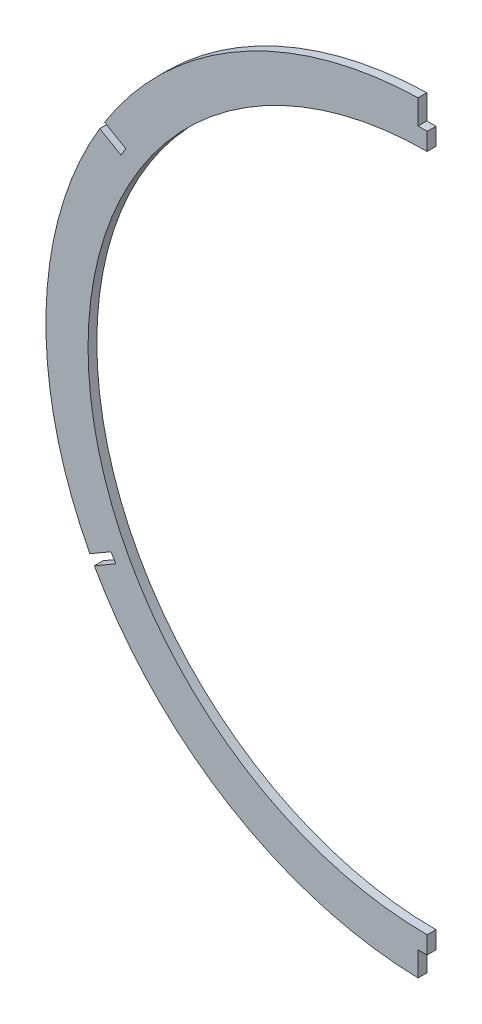
ISO-10303-21;
HEADER;
FILE_DESCRIPTION(('STEP AP214'),'2;1');
FILE_NAME('part.step','',(''),(''),'','','');
FILE_SCHEMA(('AUTOMOTIVE_DESIGN { 1 0 10303 214 1 1 1 1 }'));
ENDSEC;
DATA;
#1=APPLICATION_CONTEXT('core data for automotive mechanical design processes');
#2=APPLICATION_PROTOCOL_DEFINITION('international standard','automotive_design',2000,#1);
#3=PRODUCT_CONTEXT('',#1,'mechanical');
#4=PRODUCT('Part','Part','',(#3));
#5=PRODUCT_RELATED_PRODUCT_CATEGORY('part','',(#4));
#6=PRODUCT_DEFINITION_FORMATION('','',#4);
#7=PRODUCT_DEFINITION_CONTEXT('part definition',#1,'design');
#8=PRODUCT_DEFINITION('design','',#6,#7);
#9=PRODUCT_DEFINITION_SHAPE('','',#8);
#10=(LENGTH_UNIT() NAMED_UNIT(*) SI_UNIT(.MILLI.,.METRE.));
#11=(NAMED_UNIT(*) PLANE_ANGLE_UNIT() SI_UNIT($,.RADIAN.));
#12=(NAMED_UNIT(*) SI_UNIT($,.STERADIAN.) SOLID_ANGLE_UNIT());
#13=UNCERTAINTY_MEASURE_WITH_UNIT(LENGTH_MEASURE(1.E-05),#10,'distance_accuracy_value','');
#14=(GEOMETRIC_REPRESENTATION_CONTEXT(3) GLOBAL_UNCERTAINTY_ASSIGNED_CONTEXT((#13)) GLOBAL_UNIT_ASSIGNED_CONTEXT((#10,
#11,#12)) REPRESENTATION_CONTEXT('',''));
#15=CARTESIAN_POINT('',(0.,0.,0.));
#16=DIRECTION('',(0.,0.,1.));
#17=DIRECTION('',(1.,0.,0.));
#18=AXIS2_PLACEMENT_3D('',#15,#16,#17);
#19=CARTESIAN_POINT('',(0.,12.6999999999999,-1.58750000000003));
#20=DIRECTION('',(0.,0.,-1.));
#21=DIRECTION('',(0.,1.,0.));
#22=AXIS2_PLACEMENT_3D('',#19,#20,#21);
#23=PLANE('',#22);
#24=CARTESIAN_POINT('',(0.,12.6999999999999,-1.58750000000003));
#25=DIRECTION('',(0.,0.,-1.));
#26=DIRECTION('',(0.,1.,0.));
#27=AXIS2_PLACEMENT_3D('',#24,#25,#26);
#28=CIRCLE('',#27,137.922);
#29=CARTESIAN_POINT('',(-116.699944513499,86.2091901366513,-1.58750000000004));
#30=VERTEX_POINT('',#29);
#31=CARTESIAN_POINT('',(-3.30200000000001,150.58246763095,-1.58750000000004));
#32=VERTEX_POINT('',#31);
#33=EDGE_CURVE('E170',#30,#32,#28,.T.);
#34=ORIENTED_EDGE('',*,*,#33,.T.);
#35=DIRECTION('',(0.,1.,0.));
#36=VECTOR('',#35,1.);
#37=CARTESIAN_POINT('',(-3.30200000000001,0.,-1.58750000000004));
#38=LINE('',#37,#36);
#39=CARTESIAN_POINT('',(-3.30200000000001,141.732,-1.58750000000004));
#40=VERTEX_POINT('',#39);
#41=EDGE_CURVE('E152',#40,#32,#38,.T.);
#42=ORIENTED_EDGE('',*,*,#41,.F.);
#43=DIRECTION('',(1.,0.,0.));
#44=VECTOR('',#43,1.);
#45=CARTESIAN_POINT('',(0.,141.732,-1.58750000000004));
#46=LINE('',#45,#44);
#47=CARTESIAN_POINT('',(0.,141.732,-1.58750000000004));
#48=VERTEX_POINT('',#47);
#49=EDGE_CURVE('E159',#40,#48,#46,.T.);
#50=ORIENTED_EDGE('',*,*,#49,.T.);
#51=DIRECTION('',(0.,-1.,0.));
#52=VECTOR('',#51,1.);
#53=CARTESIAN_POINT('',(0.,12.6999999999999,-1.58750000000003));
#54=LINE('',#53,#52);
#55=CARTESIAN_POINT('',(0.,135.382,-1.58750000000003));
#56=VERTEX_POINT('',#55);
#57=EDGE_CURVE('E248',#48,#56,#54,.T.);
#58=ORIENTED_EDGE('',*,*,#57,.T.);
#59=CARTESIAN_POINT('',(0.,12.6999999999999,-1.58750000000003));
#60=DIRECTION('',(0.,0.,-1.));
#61=DIRECTION('',(0.,1.,0.));
#62=AXIS2_PLACEMENT_3D('',#59,#60,#61);
#63=CIRCLE('',#62,122.682);
#64=CARTESIAN_POINT('',(0.,-109.982,-1.58750000000002));
#65=VERTEX_POINT('',#64);
#66=EDGE_CURVE('E249',#65,#56,#63,.T.);
#67=ORIENTED_EDGE('',*,*,#66,.F.);
#68=CARTESIAN_POINT('',(0.,-116.332,-1.58750000000002));
#69=VERTEX_POINT('',#68);
#70=EDGE_CURVE('E244',#65,#69,#54,.T.);
#71=ORIENTED_EDGE('',*,*,#70,.T.);
#72=DIRECTION('',(1.,0.,0.));
#73=VECTOR('',#72,1.);
#74=CARTESIAN_POINT('',(0.,-116.332,-1.58750000000004));
#75=LINE('',#74,#73);
#76=CARTESIAN_POINT('',(-3.30200000000001,-116.332,-1.58750000000004));
#77=VERTEX_POINT('',#76);
#78=EDGE_CURVE('E226',#77,#69,#75,.T.);
#79=ORIENTED_EDGE('',*,*,#78,.F.);
#80=DIRECTION('',(0.,-1.,0.));
#81=VECTOR('',#80,1.);
#82=CARTESIAN_POINT('',(-3.30200000000001,0.,-1.58750000000004));
#83=LINE('',#82,#81);
#84=CARTESIAN_POINT('',(-3.30200000000001,-125.18246763095,-1.58750000000004));
#85=VERTEX_POINT('',#84);
#86=EDGE_CURVE('E228',#77,#85,#83,.T.);
#87=ORIENTED_EDGE('',*,*,#86,.T.);
#88=CARTESIAN_POINT('',(-120.398555387567,-54.5805019644396,-1.58750000000004));
#89=VERTEX_POINT('',#88);
#90=EDGE_CURVE('E259',#85,#89,#28,.T.);
#91=ORIENTED_EDGE('',*,*,#90,.T.);
#92=DIRECTION('',(-0.86602540378444,-0.499999999999999,0.));
#93=VECTOR('',#92,1.);
#94=CARTESIAN_POINT('',(-6.46558822063608,11.1987272989606,-1.58750000000004));
#95=LINE('',#94,#93);
#96=CARTESIAN_POINT('',(-112.665009205345,-50.1155369943434,-1.58750000000004));
#97=VERTEX_POINT('',#96);
#98=EDGE_CURVE('E203',#97,#89,#95,.T.);
#99=ORIENTED_EDGE('',*,*,#98,.F.);
#100=DIRECTION('',(-0.499999999999911,0.86602540378449,0.));
#101=VECTOR('',#100,1.);
#102=CARTESIAN_POINT('',(-106.199420984716,-61.3142642932939,-1.58750000000004));
#103=LINE('',#102,#101);
#104=CARTESIAN_POINT('',(-114.354109205345,-47.1899299752789,-1.58750000000004));
#105=VERTEX_POINT('',#104);
#106=EDGE_CURVE('E205',#97,#105,#103,.T.);
#107=ORIENTED_EDGE('',*,*,#106,.T.);
#108=DIRECTION('',(-0.866025403784449,-0.499999999999982,0.));
#109=VECTOR('',#108,1.);
#110=CARTESIAN_POINT('',(-8.1546882206345,14.1243343180231,-1.58750000000004));
#111=LINE('',#110,#109);
#112=CARTESIAN_POINT('',(-122.010798326709,-51.6105215005997,-1.58750000000004));
#113=VERTEX_POINT('',#112);
#114=EDGE_CURVE('E208',#105,#113,#111,.T.);
#115=ORIENTED_EDGE('',*,*,#114,.T.);
#116=CARTESIAN_POINT('',(-118.465901574357,83.3279565623618,-1.58750000000004));
#117=VERTEX_POINT('',#116);
#118=EDGE_CURVE('E257',#113,#117,#28,.T.);
#119=ORIENTED_EDGE('',*,*,#118,.T.);
#120=DIRECTION('',(-0.866025403784439,0.5,0.));
#121=VECTOR('',#120,1.);
#122=CARTESIAN_POINT('',(6.46558822063663,11.1987272989615,-1.58750000000004));
#123=LINE('',#122,#121);
#124=CARTESIAN_POINT('',(-110.732355392123,78.8629915922589,-1.58750000000004));
#125=VERTEX_POINT('',#124);
#126=EDGE_CURVE('E186',#125,#117,#123,.T.);
#127=ORIENTED_EDGE('',*,*,#126,.F.);
#128=DIRECTION('',(-0.5,-0.866025403784438,0.));
#129=VECTOR('',#128,1.);
#130=CARTESIAN_POINT('',(-117.19794361276,67.6642642932974,-1.58750000000004));
#131=LINE('',#130,#129);
#132=CARTESIAN_POINT('',(-109.043255392123,81.7885986113238,-1.58750000000004));
#133=VERTEX_POINT('',#132);
#134=EDGE_CURVE('E181',#133,#125,#131,.T.);
#135=ORIENTED_EDGE('',*,*,#134,.F.);
#136=DIRECTION('',(-0.866025403784438,0.500000000000002,0.));
#137=VECTOR('',#136,1.);
#138=CARTESIAN_POINT('',(8.15468822063672,14.1243343180262,-1.58750000000004));
#139=LINE('',#138,#137);
#140=EDGE_CURVE('E183',#133,#30,#139,.T.);
#141=ORIENTED_EDGE('',*,*,#140,.T.);
#142=EDGE_LOOP('',(#34,#42,#50,#58,#67,#71,#79,#87,#91,#99,#107,#115,#119,#127,#135,#141));
#143=FACE_BOUND('',#142,.T.);
#144=ADVANCED_FACE('F36',(#143),#23,.T.);
#145=CARTESIAN_POINT('',(0.,12.6999999999999,1.58749999999997));
#146=DIRECTION('',(0.,0.,-1.));
#147=DIRECTION('',(0.,1.,0.));
#148=AXIS2_PLACEMENT_3D('',#145,#146,#147);
#149=PLANE('',#148);
#150=DIRECTION('',(0.,1.,0.));
#151=VECTOR('',#150,1.);
#152=CARTESIAN_POINT('',(-3.30200000000001,0.,1.58749999999997));
#153=LINE('',#152,#151);
#154=CARTESIAN_POINT('',(-3.30200000000001,141.732,1.58749999999997));
#155=VERTEX_POINT('',#154);
#156=CARTESIAN_POINT('',(-3.30200000000001,150.58246763095,1.58749999999997));
#157=VERTEX_POINT('',#156);
#158=EDGE_CURVE('E155',#155,#157,#153,.T.);
#159=ORIENTED_EDGE('',*,*,#158,.T.);
#160=CARTESIAN_POINT('',(0.,12.6999999999999,1.58749999999997));
#161=DIRECTION('',(0.,0.,-1.));
#162=DIRECTION('',(0.,1.,0.));
#163=AXIS2_PLACEMENT_3D('',#160,#161,#162);
#164=CIRCLE('',#163,137.922);
#165=CARTESIAN_POINT('',(-116.699944513499,86.2091901366513,1.58749999999997));
#166=VERTEX_POINT('',#165);
#167=EDGE_CURVE('E252',#166,#157,#164,.T.);
#168=ORIENTED_EDGE('',*,*,#167,.F.);
#169=DIRECTION('',(-0.866025403784438,0.500000000000002,0.));
#170=VECTOR('',#169,1.);
#171=CARTESIAN_POINT('',(8.15468822063672,14.1243343180262,1.58749999999997));
#172=LINE('',#171,#170);
#173=CARTESIAN_POINT('',(-109.043255392123,81.7885986113238,1.58749999999997));
#174=VERTEX_POINT('',#173);
#175=EDGE_CURVE('E51',#174,#166,#172,.T.);
#176=ORIENTED_EDGE('',*,*,#175,.F.);
#177=DIRECTION('',(-0.5,-0.866025403784438,0.));
#178=VECTOR('',#177,1.);
#179=CARTESIAN_POINT('',(-117.19794361276,67.6642642932974,1.58749999999997));
#180=LINE('',#179,#178);
#181=CARTESIAN_POINT('',(-110.732355392123,78.8629915922589,1.58749999999997));
#182=VERTEX_POINT('',#181);
#183=EDGE_CURVE('E189',#174,#182,#180,.T.);
#184=ORIENTED_EDGE('',*,*,#183,.T.);
#185=DIRECTION('',(-0.866025403784439,0.5,0.));
#186=VECTOR('',#185,1.);
#187=CARTESIAN_POINT('',(6.46558822063663,11.1987272989615,1.58749999999997));
#188=LINE('',#187,#186);
#189=CARTESIAN_POINT('',(-118.465901574357,83.3279565623618,1.58749999999997));
#190=VERTEX_POINT('',#189);
#191=EDGE_CURVE('E184',#182,#190,#188,.T.);
#192=ORIENTED_EDGE('',*,*,#191,.T.);
#193=CARTESIAN_POINT('',(-122.010798326709,-51.6105215005997,1.58749999999998));
#194=VERTEX_POINT('',#193);
#195=EDGE_CURVE('E261',#194,#190,#164,.T.);
#196=ORIENTED_EDGE('',*,*,#195,.F.);
#197=DIRECTION('',(-0.866025403784449,-0.499999999999982,0.));
#198=VECTOR('',#197,1.);
#199=CARTESIAN_POINT('',(-8.1546882206345,14.1243343180231,1.58749999999997));
#200=LINE('',#199,#198);
#201=CARTESIAN_POINT('',(-114.354109205345,-47.1899299752789,1.58749999999997));
#202=VERTEX_POINT('',#201);
#203=EDGE_CURVE('E59',#202,#194,#200,.T.);
#204=ORIENTED_EDGE('',*,*,#203,.F.);
#205=DIRECTION('',(-0.499999999999911,0.86602540378449,0.));
#206=VECTOR('',#205,1.);
#207=CARTESIAN_POINT('',(-106.199420984716,-61.3142642932939,1.58749999999997));
#208=LINE('',#207,#206);
#209=CARTESIAN_POINT('',(-112.665009205345,-50.1155369943434,1.58749999999997));
#210=VERTEX_POINT('',#209);
#211=EDGE_CURVE('E215',#210,#202,#208,.T.);
#212=ORIENTED_EDGE('',*,*,#211,.F.);
#213=DIRECTION('',(-0.86602540378444,-0.499999999999999,0.));
#214=VECTOR('',#213,1.);
#215=CARTESIAN_POINT('',(-6.46558822063608,11.1987272989606,1.58749999999997));
#216=LINE('',#215,#214);
#217=CARTESIAN_POINT('',(-120.398555387567,-54.5805019644396,1.58749999999997));
#218=VERTEX_POINT('',#217);
#219=EDGE_CURVE('E212',#210,#218,#216,.T.);
#220=ORIENTED_EDGE('',*,*,#219,.T.);
#221=CARTESIAN_POINT('',(-3.30200000000001,-125.18246763095,1.58749999999997));
#222=VERTEX_POINT('',#221);
#223=EDGE_CURVE('E258',#222,#218,#164,.T.);
#224=ORIENTED_EDGE('',*,*,#223,.F.);
#225=DIRECTION('',(0.,-1.,0.));
#226=VECTOR('',#225,1.);
#227=CARTESIAN_POINT('',(-3.30200000000001,0.,1.58749999999997));
#228=LINE('',#227,#226);
#229=CARTESIAN_POINT('',(-3.30200000000001,-116.332,1.58749999999997));
#230=VERTEX_POINT('',#229);
#231=EDGE_CURVE('E229',#230,#222,#228,.T.);
#232=ORIENTED_EDGE('',*,*,#231,.F.);
#233=DIRECTION('',(1.,0.,0.));
#234=VECTOR('',#233,1.);
#235=CARTESIAN_POINT('',(0.,-116.332,1.58749999999997));
#236=LINE('',#235,#234);
#237=CARTESIAN_POINT('',(0.,-116.332,1.58749999999997));
#238=VERTEX_POINT('',#237);
#239=EDGE_CURVE('E233',#230,#238,#236,.T.);
#240=ORIENTED_EDGE('',*,*,#239,.T.);
#241=DIRECTION('',(0.,-1.,0.));
#242=VECTOR('',#241,1.);
#243=CARTESIAN_POINT('',(0.,12.6999999999999,1.58749999999997));
#244=LINE('',#243,#242);
#245=CARTESIAN_POINT('',(0.,-109.982,1.58749999999997));
#246=VERTEX_POINT('',#245);
#247=EDGE_CURVE('E179',#246,#238,#244,.T.);
#248=ORIENTED_EDGE('',*,*,#247,.F.);
#249=CARTESIAN_POINT('',(0.,12.6999999999999,1.58749999999997));
#250=DIRECTION('',(0.,0.,-1.));
#251=DIRECTION('',(0.,1.,0.));
#252=AXIS2_PLACEMENT_3D('',#249,#250,#251);
#253=CIRCLE('',#252,122.682);
#254=CARTESIAN_POINT('',(0.,135.382,1.58749999999997));
#255=VERTEX_POINT('',#254);
#256=EDGE_CURVE('E253',#246,#255,#253,.T.);
#257=ORIENTED_EDGE('',*,*,#256,.T.);
#258=CARTESIAN_POINT('',(0.,141.732,1.58749999999996));
#259=VERTEX_POINT('',#258);
#260=EDGE_CURVE('E245',#259,#255,#244,.T.);
#261=ORIENTED_EDGE('',*,*,#260,.F.);
#262=DIRECTION('',(1.,0.,0.));
#263=VECTOR('',#262,1.);
#264=CARTESIAN_POINT('',(0.,141.732,1.58749999999997));
#265=LINE('',#264,#263);
#266=EDGE_CURVE('E171',#155,#259,#265,.T.);
#267=ORIENTED_EDGE('',*,*,#266,.F.);
#268=EDGE_LOOP('',(#159,#168,#176,#184,#192,#196,#204,#212,#220,#224,#232,#240,#248,#257,#261,#267));
#269=FACE_BOUND('',#268,.T.);
#270=ADVANCED_FACE('F283',(#269),#149,.F.);
#271=CARTESIAN_POINT('',(0.,12.6999999999999,-1.58750000000003));
#272=DIRECTION('',(0.,0.,1.));
#273=DIRECTION('',(0.,-1.,0.));
#274=AXIS2_PLACEMENT_3D('',#271,#272,#273);
#275=CYLINDRICAL_SURFACE('',#274,137.922);
#276=DIRECTION('',(0.,0.,1.));
#277=VECTOR('',#276,1.);
#278=CARTESIAN_POINT('',(-3.30200000000001,150.58246763095,-1.58750000000004));
#279=LINE('',#278,#277);
#280=EDGE_CURVE('E177',#32,#157,#279,.T.);
#281=ORIENTED_EDGE('',*,*,#280,.F.);
#282=ORIENTED_EDGE('',*,*,#33,.F.);
#283=DIRECTION('',(0.,0.,1.));
#284=VECTOR('',#283,1.);
#285=CARTESIAN_POINT('',(-116.699944513499,86.2091901366513,-1.58750000000004));
#286=LINE('',#285,#284);
#287=EDGE_CURVE('E200',#30,#166,#286,.T.);
#288=ORIENTED_EDGE('',*,*,#287,.T.);
#289=ORIENTED_EDGE('',*,*,#167,.T.);
#290=EDGE_LOOP('',(#281,#282,#288,#289));
#291=FACE_BOUND('',#290,.T.);
#292=ADVANCED_FACE('F38',(#291),#275,.T.);
#293=DIRECTION('',(0.,0.,1.));
#294=VECTOR('',#293,1.);
#295=CARTESIAN_POINT('',(-118.465901574357,83.3279565623618,-1.58750000000004));
#296=LINE('',#295,#294);
#297=EDGE_CURVE('E198',#117,#190,#296,.T.);
#298=ORIENTED_EDGE('',*,*,#297,.F.);
#299=ORIENTED_EDGE('',*,*,#118,.F.);
#300=DIRECTION('',(0.,0.,1.));
#301=VECTOR('',#300,1.);
#302=CARTESIAN_POINT('',(-122.010798326709,-51.6105215005997,-1.58750000000004));
#303=LINE('',#302,#301);
#304=EDGE_CURVE('E221',#113,#194,#303,.T.);
#305=ORIENTED_EDGE('',*,*,#304,.T.);
#306=ORIENTED_EDGE('',*,*,#195,.T.);
#307=EDGE_LOOP('',(#298,#299,#305,#306));
#308=FACE_BOUND('',#307,.T.);
#309=ADVANCED_FACE('F276',(#308),#275,.T.);
#310=DIRECTION('',(0.,0.,1.));
#311=VECTOR('',#310,1.);
#312=CARTESIAN_POINT('',(-120.398555387567,-54.5805019644396,-1.58750000000004));
#313=LINE('',#312,#311);
#314=EDGE_CURVE('E192',#89,#218,#313,.T.);
#315=ORIENTED_EDGE('',*,*,#314,.F.);
#316=ORIENTED_EDGE('',*,*,#90,.F.);
#317=DIRECTION('',(0.,0.,1.));
#318=VECTOR('',#317,1.);
#319=CARTESIAN_POINT('',(-3.30200000000001,-125.18246763095,-1.58750000000004));
#320=LINE('',#319,#318);
#321=EDGE_CURVE('E238',#85,#222,#320,.T.);
#322=ORIENTED_EDGE('',*,*,#321,.T.);
#323=ORIENTED_EDGE('',*,*,#223,.T.);
#324=EDGE_LOOP('',(#315,#316,#322,#323));
#325=FACE_BOUND('',#324,.T.);
#326=ADVANCED_FACE('F308',(#325),#275,.T.);
#327=CARTESIAN_POINT('',(0.,0.,0.));
#328=DIRECTION('',(1.,0.,0.));
#329=DIRECTION('',(0.,0.,-1.));
#330=AXIS2_PLACEMENT_3D('',#327,#328,#329);
#331=PLANE('',#330);
#332=ORIENTED_EDGE('',*,*,#247,.T.);
#333=DIRECTION('',(0.,0.,1.));
#334=VECTOR('',#333,1.);
#335=CARTESIAN_POINT('',(0.,-116.332,-1.58750000000004));
#336=LINE('',#335,#334);
#337=EDGE_CURVE('E216',#69,#238,#336,.T.);
#338=ORIENTED_EDGE('',*,*,#337,.F.);
#339=ORIENTED_EDGE('',*,*,#70,.F.);
#340=DIRECTION('',(0.,0.,1.));
#341=VECTOR('',#340,1.);
#342=CARTESIAN_POINT('',(0.,-109.982,-1.58750000000002));
#343=LINE('',#342,#341);
#344=EDGE_CURVE('E44',#246,#65,#343,.F.);
#345=ORIENTED_EDGE('',*,*,#344,.F.);
#346=EDGE_LOOP('',(#332,#338,#339,#345));
#347=FACE_BOUND('',#346,.T.);
#348=ADVANCED_FACE('F301',(#347),#331,.T.);
#349=CARTESIAN_POINT('',(0.,12.6999999999999,-1.58750000000003));
#350=DIRECTION('',(0.,0.,1.));
#351=DIRECTION('',(0.,-1.,0.));
#352=AXIS2_PLACEMENT_3D('',#349,#350,#351);
#353=CYLINDRICAL_SURFACE('',#352,122.682);
#354=ORIENTED_EDGE('',*,*,#66,.T.);
#355=DIRECTION('',(0.,0.,1.));
#356=VECTOR('',#355,1.);
#357=CARTESIAN_POINT('',(0.,135.382,-1.58750000000003));
#358=LINE('',#357,#356);
#359=EDGE_CURVE('E11',#56,#255,#358,.T.);
#360=ORIENTED_EDGE('',*,*,#359,.T.);
#361=ORIENTED_EDGE('',*,*,#256,.F.);
#362=ORIENTED_EDGE('',*,*,#344,.T.);
#363=EDGE_LOOP('',(#354,#360,#361,#362));
#364=FACE_BOUND('',#363,.T.);
#365=ADVANCED_FACE('F295',(#364),#353,.F.);
#366=DIRECTION('',(0.,0.,1.));
#367=VECTOR('',#366,1.);
#368=CARTESIAN_POINT('',(0.,141.732,-1.58750000000004));
#369=LINE('',#368,#367);
#370=EDGE_CURVE('E158',#48,#259,#369,.T.);
#371=ORIENTED_EDGE('',*,*,#370,.T.);
#372=ORIENTED_EDGE('',*,*,#260,.T.);
#373=ORIENTED_EDGE('',*,*,#359,.F.);
#374=ORIENTED_EDGE('',*,*,#57,.F.);
#375=EDGE_LOOP('',(#371,#372,#373,#374));
#376=FACE_BOUND('',#375,.T.);
#377=ADVANCED_FACE('F292',(#376),#331,.T.);
#378=CARTESIAN_POINT('',(-3.30200000000001,0.,-1.58750000000004));
#379=DIRECTION('',(1.,0.,0.));
#380=DIRECTION('',(0.,0.,-1.));
#381=AXIS2_PLACEMENT_3D('',#378,#379,#380);
#382=PLANE('',#381);
#383=ORIENTED_EDGE('',*,*,#158,.F.);
#384=DIRECTION('',(0.,0.,1.));
#385=VECTOR('',#384,1.);
#386=CARTESIAN_POINT('',(-3.30200000000001,141.732,-1.58750000000004));
#387=LINE('',#386,#385);
#388=EDGE_CURVE('E148',#40,#155,#387,.T.);
#389=ORIENTED_EDGE('',*,*,#388,.F.);
#390=ORIENTED_EDGE('',*,*,#41,.T.);
#391=ORIENTED_EDGE('',*,*,#280,.T.);
#392=EDGE_LOOP('',(#383,#389,#390,#391));
#393=FACE_BOUND('',#392,.T.);
#394=ADVANCED_FACE('F150',(#393),#382,.T.);
#395=CARTESIAN_POINT('',(0.,141.732,-1.58750000000004));
#396=DIRECTION('',(0.,-1.,0.));
#397=DIRECTION('',(0.,0.,-1.));
#398=AXIS2_PLACEMENT_3D('',#395,#396,#397);
#399=PLANE('',#398);
#400=ORIENTED_EDGE('',*,*,#266,.T.);
#401=ORIENTED_EDGE('',*,*,#370,.F.);
#402=ORIENTED_EDGE('',*,*,#49,.F.);
#403=ORIENTED_EDGE('',*,*,#388,.T.);
#404=EDGE_LOOP('',(#400,#401,#402,#403));
#405=FACE_BOUND('',#404,.T.);
#406=ADVANCED_FACE('F162',(#405),#399,.F.);
#407=CARTESIAN_POINT('',(0.,-116.332,-1.58750000000004));
#408=DIRECTION('',(0.,-1.,0.));
#409=DIRECTION('',(0.,0.,-1.));
#410=AXIS2_PLACEMENT_3D('',#407,#408,#409);
#411=PLANE('',#410);
#412=ORIENTED_EDGE('',*,*,#239,.F.);
#413=DIRECTION('',(0.,0.,1.));
#414=VECTOR('',#413,1.);
#415=CARTESIAN_POINT('',(-3.30200000000001,-116.332,-1.58750000000004));
#416=LINE('',#415,#414);
#417=EDGE_CURVE('E232',#77,#230,#416,.T.);
#418=ORIENTED_EDGE('',*,*,#417,.F.);
#419=ORIENTED_EDGE('',*,*,#78,.T.);
#420=ORIENTED_EDGE('',*,*,#337,.T.);
#421=EDGE_LOOP('',(#412,#418,#419,#420));
#422=FACE_BOUND('',#421,.T.);
#423=ADVANCED_FACE('F303',(#422),#411,.T.);
#424=CARTESIAN_POINT('',(-3.30200000000001,0.,-1.58750000000004));
#425=DIRECTION('',(-1.,0.,0.));
#426=DIRECTION('',(0.,0.,1.));
#427=AXIS2_PLACEMENT_3D('',#424,#425,#426);
#428=PLANE('',#427);
#429=ORIENTED_EDGE('',*,*,#231,.T.);
#430=ORIENTED_EDGE('',*,*,#321,.F.);
#431=ORIENTED_EDGE('',*,*,#86,.F.);
#432=ORIENTED_EDGE('',*,*,#417,.T.);
#433=EDGE_LOOP('',(#429,#430,#431,#432));
#434=FACE_BOUND('',#433,.T.);
#435=ADVANCED_FACE('F326',(#434),#428,.F.);
#436=CARTESIAN_POINT('',(-6.46558822063608,11.1987272989606,-1.58750000000004));
#437=DIRECTION('',(-0.499999999999999,0.866025403784439,0.));
#438=DIRECTION('',(-0.866025403784439,-0.499999999999999,0.));
#439=AXIS2_PLACEMENT_3D('',#436,#437,#438);
#440=PLANE('',#439);
#441=ORIENTED_EDGE('',*,*,#219,.F.);
#442=DIRECTION('',(0.,0.,1.));
#443=VECTOR('',#442,1.);
#444=CARTESIAN_POINT('',(-112.665009205345,-50.1155369943434,-1.58750000000004));
#445=LINE('',#444,#443);
#446=EDGE_CURVE('E211',#97,#210,#445,.T.);
#447=ORIENTED_EDGE('',*,*,#446,.F.);
#448=ORIENTED_EDGE('',*,*,#98,.T.);
#449=ORIENTED_EDGE('',*,*,#314,.T.);
#450=EDGE_LOOP('',(#441,#447,#448,#449));
#451=FACE_BOUND('',#450,.T.);
#452=ADVANCED_FACE('F313',(#451),#440,.T.);
#453=CARTESIAN_POINT('',(-8.1546882206345,14.1243343180231,-1.58750000000004));
#454=DIRECTION('',(-0.499999999999982,0.866025403784449,0.));
#455=DIRECTION('',(-0.866025403784449,-0.499999999999982,0.));
#456=AXIS2_PLACEMENT_3D('',#453,#454,#455);
#457=PLANE('',#456);
#458=ORIENTED_EDGE('',*,*,#203,.T.);
#459=ORIENTED_EDGE('',*,*,#304,.F.);
#460=ORIENTED_EDGE('',*,*,#114,.F.);
#461=DIRECTION('',(0.,0.,1.));
#462=VECTOR('',#461,1.);
#463=CARTESIAN_POINT('',(-114.354109205345,-47.1899299752789,-1.58750000000004));
#464=LINE('',#463,#462);
#465=EDGE_CURVE('E223',#105,#202,#464,.T.);
#466=ORIENTED_EDGE('',*,*,#465,.T.);
#467=EDGE_LOOP('',(#458,#459,#460,#466));
#468=FACE_BOUND('',#467,.T.);
#469=ADVANCED_FACE('F318',(#468),#457,.F.);
#470=CARTESIAN_POINT('',(-106.199420984716,-61.3142642932939,-1.58750000000004));
#471=DIRECTION('',(0.86602540378449,0.499999999999911,0.));
#472=DIRECTION('',(-0.499999999999911,0.86602540378449,0.));
#473=AXIS2_PLACEMENT_3D('',#470,#471,#472);
#474=PLANE('',#473);
#475=ORIENTED_EDGE('',*,*,#211,.T.);
#476=ORIENTED_EDGE('',*,*,#465,.F.);
#477=ORIENTED_EDGE('',*,*,#106,.F.);
#478=ORIENTED_EDGE('',*,*,#446,.T.);
#479=EDGE_LOOP('',(#475,#476,#477,#478));
#480=FACE_BOUND('',#479,.T.);
#481=ADVANCED_FACE('F316',(#480),#474,.F.);
#482=CARTESIAN_POINT('',(-117.19794361276,67.6642642932974,-1.58750000000004));
#483=DIRECTION('',(-0.866025403784439,0.5,0.));
#484=DIRECTION('',(-0.5,-0.866025403784439,0.));
#485=AXIS2_PLACEMENT_3D('',#482,#483,#484);
#486=PLANE('',#485);
#487=ORIENTED_EDGE('',*,*,#183,.F.);
#488=DIRECTION('',(0.,0.,1.));
#489=VECTOR('',#488,1.);
#490=CARTESIAN_POINT('',(-109.043255392123,81.7885986113238,-1.58750000000004));
#491=LINE('',#490,#489);
#492=EDGE_CURVE('E188',#133,#174,#491,.T.);
#493=ORIENTED_EDGE('',*,*,#492,.F.);
#494=ORIENTED_EDGE('',*,*,#134,.T.);
#495=DIRECTION('',(0.,0.,1.));
#496=VECTOR('',#495,1.);
#497=CARTESIAN_POINT('',(-110.732355392123,78.8629915922589,-1.58750000000004));
#498=LINE('',#497,#496);
#499=EDGE_CURVE('E175',#125,#182,#498,.T.);
#500=ORIENTED_EDGE('',*,*,#499,.T.);
#501=EDGE_LOOP('',(#487,#493,#494,#500));
#502=FACE_BOUND('',#501,.T.);
#503=ADVANCED_FACE('F287',(#502),#486,.T.);
#504=CARTESIAN_POINT('',(6.46558822063663,11.1987272989615,-1.58750000000004));
#505=DIRECTION('',(0.5,0.866025403784439,0.));
#506=DIRECTION('',(-0.866025403784439,0.5,0.));
#507=AXIS2_PLACEMENT_3D('',#504,#505,#506);
#508=PLANE('',#507);
#509=ORIENTED_EDGE('',*,*,#191,.F.);
#510=ORIENTED_EDGE('',*,*,#499,.F.);
#511=ORIENTED_EDGE('',*,*,#126,.T.);
#512=ORIENTED_EDGE('',*,*,#297,.T.);
#513=EDGE_LOOP('',(#509,#510,#511,#512));
#514=FACE_BOUND('',#513,.T.);
#515=ADVANCED_FACE('F280',(#514),#508,.T.);
#516=CARTESIAN_POINT('',(8.15468822063672,14.1243343180262,-1.58750000000004));
#517=DIRECTION('',(0.500000000000002,0.866025403784438,0.));
#518=DIRECTION('',(-0.866025403784438,0.500000000000002,0.));
#519=AXIS2_PLACEMENT_3D('',#516,#517,#518);
#520=PLANE('',#519);
#521=ORIENTED_EDGE('',*,*,#175,.T.);
#522=ORIENTED_EDGE('',*,*,#287,.F.);
#523=ORIENTED_EDGE('',*,*,#140,.F.);
#524=ORIENTED_EDGE('',*,*,#492,.T.);
#525=EDGE_LOOP('',(#521,#522,#523,#524));
#526=FACE_BOUND('',#525,.T.);
#527=ADVANCED_FACE('F381',(#526),#520,.F.);
#528=CLOSED_SHELL('',(#144,#270,#292,#309,#326,#348,#365,#377,#394,#406,#423,#435,#452,#469,
#481,#503,#515,#527));
#529=MANIFOLD_SOLID_BREP('B2',#528);
#530=ADVANCED_BREP_SHAPE_REPRESENTATION('',(#18,#529),#14);
#531=SHAPE_DEFINITION_REPRESENTATION(#9,#530);
ENDSEC;
END-ISO-10303-21;
